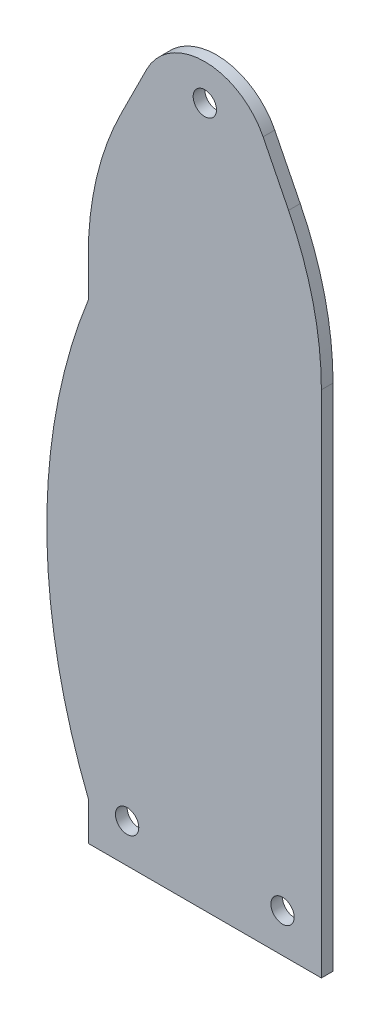
ISO-10303-21;
HEADER;
FILE_DESCRIPTION(('STEP AP214'),'2;1');
FILE_NAME('part.step','',(''),(''),'','','');
FILE_SCHEMA(('AUTOMOTIVE_DESIGN { 1 0 10303 214 1 1 1 1 }'));
ENDSEC;
DATA;
#1=APPLICATION_CONTEXT('core data for automotive mechanical design processes');
#2=APPLICATION_PROTOCOL_DEFINITION('international standard','automotive_design',2000,#1);
#3=PRODUCT_CONTEXT('',#1,'mechanical');
#4=PRODUCT('Part','Part','',(#3));
#5=PRODUCT_RELATED_PRODUCT_CATEGORY('part','',(#4));
#6=PRODUCT_DEFINITION_FORMATION('','',#4);
#7=PRODUCT_DEFINITION_CONTEXT('part definition',#1,'design');
#8=PRODUCT_DEFINITION('design','',#6,#7);
#9=PRODUCT_DEFINITION_SHAPE('','',#8);
#10=(LENGTH_UNIT() NAMED_UNIT(*) SI_UNIT(.MILLI.,.METRE.));
#11=(NAMED_UNIT(*) PLANE_ANGLE_UNIT() SI_UNIT($,.RADIAN.));
#12=(NAMED_UNIT(*) SI_UNIT($,.STERADIAN.) SOLID_ANGLE_UNIT());
#13=UNCERTAINTY_MEASURE_WITH_UNIT(LENGTH_MEASURE(1.E-05),#10,'distance_accuracy_value','');
#14=(GEOMETRIC_REPRESENTATION_CONTEXT(3) GLOBAL_UNCERTAINTY_ASSIGNED_CONTEXT((#13)) GLOBAL_UNIT_ASSIGNED_CONTEXT((#10,
#11,#12)) REPRESENTATION_CONTEXT('',''));
#15=CARTESIAN_POINT('',(0.,0.,0.));
#16=DIRECTION('',(0.,0.,1.));
#17=DIRECTION('',(1.,0.,0.));
#18=AXIS2_PLACEMENT_3D('',#15,#16,#17);
#19=CARTESIAN_POINT('',(-20.,131.114561800017,3.));
#20=DIRECTION('',(0.,0.,1.));
#21=DIRECTION('',(1.,0.,0.));
#22=AXIS2_PLACEMENT_3D('',#19,#20,#21);
#23=PLANE('',#22);
#24=CARTESIAN_POINT('',(30.,180.,3.));
#25=DIRECTION('',(0.,0.,1.));
#26=DIRECTION('',(1.,0.,0.));
#27=AXIS2_PLACEMENT_3D('',#24,#25,#26);
#28=CIRCLE('',#27,3.);
#29=CARTESIAN_POINT('',(33.,180.,3.));
#30=VERTEX_POINT('',#29);
#31=EDGE_CURVE('E217',#30,#30,#28,.T.);
#32=ORIENTED_EDGE('',*,*,#31,.F.);
#33=EDGE_LOOP('',(#32));
#34=FACE_BOUND('',#33,.T.);
#35=CARTESIAN_POINT('',(-20.,131.114561800017,3.));
#36=DIRECTION('',(0.,0.,1.));
#37=DIRECTION('',(1.,0.,0.));
#38=AXIS2_PLACEMENT_3D('',#35,#36,#37);
#39=CIRCLE('',#38,80.);
#40=CARTESIAN_POINT('',(60.,131.114561800017,3.));
#41=VERTEX_POINT('',#40);
#42=CARTESIAN_POINT('',(51.5541752799932,166.891649440013,3.));
#43=VERTEX_POINT('',#42);
#44=EDGE_CURVE('E166',#41,#43,#39,.T.);
#45=ORIENTED_EDGE('',*,*,#44,.T.);
#46=DIRECTION('',(-0.447213595499958,0.894427190999916,0.));
#47=VECTOR('',#46,1.);
#48=CARTESIAN_POINT('',(51.5541752799932,166.891649440013,3.));
#49=LINE('',#48,#47);
#50=CARTESIAN_POINT('',(45.,180.,3.));
#51=VERTEX_POINT('',#50);
#52=EDGE_CURVE('E104',#43,#51,#49,.T.);
#53=ORIENTED_EDGE('',*,*,#52,.T.);
#54=CARTESIAN_POINT('',(30.,172.5,3.));
#55=DIRECTION('',(0.,0.,1.));
#56=DIRECTION('',(-1.,0.,0.));
#57=AXIS2_PLACEMENT_3D('',#54,#55,#56);
#58=CIRCLE('',#57,16.7705098312484);
#59=CARTESIAN_POINT('',(15.,180.,3.));
#60=VERTEX_POINT('',#59);
#61=EDGE_CURVE('E187',#51,#60,#58,.T.);
#62=ORIENTED_EDGE('',*,*,#61,.T.);
#63=DIRECTION('',(-0.447213595499958,-0.894427190999916,0.));
#64=VECTOR('',#63,1.);
#65=CARTESIAN_POINT('',(8.44582472000671,166.891649440013,3.));
#66=LINE('',#65,#64);
#67=CARTESIAN_POINT('',(8.44582472000671,166.891649440013,3.));
#68=VERTEX_POINT('',#67);
#69=EDGE_CURVE('E206',#60,#68,#66,.T.);
#70=ORIENTED_EDGE('',*,*,#69,.T.);
#71=CARTESIAN_POINT('',(80.,131.114561800017,3.));
#72=DIRECTION('',(0.,0.,1.));
#73=DIRECTION('',(-1.,0.,0.));
#74=AXIS2_PLACEMENT_3D('',#71,#72,#73);
#75=CIRCLE('',#74,80.);
#76=CARTESIAN_POINT('',(0.,131.114561800017,3.));
#77=VERTEX_POINT('',#76);
#78=EDGE_CURVE('E203',#68,#77,#75,.T.);
#79=ORIENTED_EDGE('',*,*,#78,.T.);
#80=DIRECTION('',(0.,-1.,0.));
#81=VECTOR('',#80,1.);
#82=CARTESIAN_POINT('',(0.,131.114561800017,3.));
#83=LINE('',#82,#81);
#84=CARTESIAN_POINT('',(0.,121.114561800017,3.));
#85=VERTEX_POINT('',#84);
#86=EDGE_CURVE('E205',#77,#85,#83,.T.);
#87=ORIENTED_EDGE('',*,*,#86,.T.);
#88=CARTESIAN_POINT('',(139.331936536451,65.5572809000084,3.));
#89=DIRECTION('',(0.,0.,1.));
#90=DIRECTION('',(-1.,0.,0.));
#91=AXIS2_PLACEMENT_3D('',#88,#89,#90);
#92=CIRCLE('',#91,150.);
#93=CARTESIAN_POINT('',(0.,10.,3.));
#94=VERTEX_POINT('',#93);
#95=EDGE_CURVE('E129',#85,#94,#92,.T.);
#96=ORIENTED_EDGE('',*,*,#95,.T.);
#97=DIRECTION('',(0.,-1.,0.));
#98=VECTOR('',#97,1.);
#99=CARTESIAN_POINT('',(0.,10.,3.));
#100=LINE('',#99,#98);
#101=CARTESIAN_POINT('',(0.,0.,3.));
#102=VERTEX_POINT('',#101);
#103=EDGE_CURVE('E123',#94,#102,#100,.T.);
#104=ORIENTED_EDGE('',*,*,#103,.T.);
#105=DIRECTION('',(1.,0.,0.));
#106=VECTOR('',#105,1.);
#107=CARTESIAN_POINT('',(0.,0.,3.));
#108=LINE('',#107,#106);
#109=CARTESIAN_POINT('',(60.,0.,3.));
#110=VERTEX_POINT('',#109);
#111=EDGE_CURVE('E127',#102,#110,#108,.T.);
#112=ORIENTED_EDGE('',*,*,#111,.T.);
#113=DIRECTION('',(0.,1.,0.));
#114=VECTOR('',#113,1.);
#115=CARTESIAN_POINT('',(60.,131.114561800017,3.));
#116=LINE('',#115,#114);
#117=EDGE_CURVE('E55',#110,#41,#116,.T.);
#118=ORIENTED_EDGE('',*,*,#117,.T.);
#119=EDGE_LOOP('',(#45,#53,#62,#70,#79,#87,#96,#104,#112,#118));
#120=FACE_BOUND('',#119,.T.);
#121=CARTESIAN_POINT('',(50.,10.,3.));
#122=DIRECTION('',(0.,0.,1.));
#123=DIRECTION('',(-1.,0.,0.));
#124=AXIS2_PLACEMENT_3D('',#121,#122,#123);
#125=CIRCLE('',#124,3.);
#126=CARTESIAN_POINT('',(47.,10.,3.));
#127=VERTEX_POINT('',#126);
#128=EDGE_CURVE('E151',#127,#127,#125,.T.);
#129=ORIENTED_EDGE('',*,*,#128,.F.);
#130=EDGE_LOOP('',(#129));
#131=FACE_BOUND('',#130,.T.);
#132=CARTESIAN_POINT('',(10.,10.,3.));
#133=DIRECTION('',(0.,0.,1.));
#134=DIRECTION('',(1.,0.,0.));
#135=AXIS2_PLACEMENT_3D('',#132,#133,#134);
#136=CIRCLE('',#135,3.);
#137=CARTESIAN_POINT('',(13.,10.,3.));
#138=VERTEX_POINT('',#137);
#139=EDGE_CURVE('E223',#138,#138,#136,.T.);
#140=ORIENTED_EDGE('',*,*,#139,.F.);
#141=EDGE_LOOP('',(#140));
#142=FACE_BOUND('',#141,.T.);
#143=ADVANCED_FACE('F38',(#34,#120,#131,#142),#23,.T.);
#144=CARTESIAN_POINT('',(-20.,131.114561800017,0.));
#145=DIRECTION('',(0.,0.,1.));
#146=DIRECTION('',(1.,0.,0.));
#147=AXIS2_PLACEMENT_3D('',#144,#145,#146);
#148=PLANE('',#147);
#149=CARTESIAN_POINT('',(30.,180.,0.));
#150=DIRECTION('',(0.,0.,1.));
#151=DIRECTION('',(1.,0.,0.));
#152=AXIS2_PLACEMENT_3D('',#149,#150,#151);
#153=CIRCLE('',#152,3.);
#154=CARTESIAN_POINT('',(33.,180.,0.));
#155=VERTEX_POINT('',#154);
#156=EDGE_CURVE('E220',#155,#155,#153,.T.);
#157=ORIENTED_EDGE('',*,*,#156,.T.);
#158=EDGE_LOOP('',(#157));
#159=FACE_BOUND('',#158,.T.);
#160=CARTESIAN_POINT('',(-20.,131.114561800017,0.));
#161=DIRECTION('',(0.,0.,1.));
#162=DIRECTION('',(1.,0.,0.));
#163=AXIS2_PLACEMENT_3D('',#160,#161,#162);
#164=CIRCLE('',#163,80.);
#165=CARTESIAN_POINT('',(60.,131.114561800017,0.));
#166=VERTEX_POINT('',#165);
#167=CARTESIAN_POINT('',(51.5541752799932,166.891649440013,0.));
#168=VERTEX_POINT('',#167);
#169=EDGE_CURVE('E147',#166,#168,#164,.T.);
#170=ORIENTED_EDGE('',*,*,#169,.F.);
#171=DIRECTION('',(0.,1.,0.));
#172=VECTOR('',#171,1.);
#173=CARTESIAN_POINT('',(60.,131.114561800017,0.));
#174=LINE('',#173,#172);
#175=CARTESIAN_POINT('',(60.,0.,0.));
#176=VERTEX_POINT('',#175);
#177=EDGE_CURVE('E96',#176,#166,#174,.T.);
#178=ORIENTED_EDGE('',*,*,#177,.F.);
#179=DIRECTION('',(1.,0.,0.));
#180=VECTOR('',#179,1.);
#181=CARTESIAN_POINT('',(0.,0.,0.));
#182=LINE('',#181,#180);
#183=CARTESIAN_POINT('',(0.,0.,0.));
#184=VERTEX_POINT('',#183);
#185=EDGE_CURVE('E90',#184,#176,#182,.T.);
#186=ORIENTED_EDGE('',*,*,#185,.F.);
#187=DIRECTION('',(0.,-1.,0.));
#188=VECTOR('',#187,1.);
#189=CARTESIAN_POINT('',(0.,10.,0.));
#190=LINE('',#189,#188);
#191=CARTESIAN_POINT('',(0.,10.,0.));
#192=VERTEX_POINT('',#191);
#193=EDGE_CURVE('E137',#192,#184,#190,.T.);
#194=ORIENTED_EDGE('',*,*,#193,.F.);
#195=CARTESIAN_POINT('',(139.331936536451,65.5572809000084,0.));
#196=DIRECTION('',(0.,0.,1.));
#197=DIRECTION('',(-1.,0.,0.));
#198=AXIS2_PLACEMENT_3D('',#195,#196,#197);
#199=CIRCLE('',#198,150.);
#200=CARTESIAN_POINT('',(0.,121.114561800017,0.));
#201=VERTEX_POINT('',#200);
#202=EDGE_CURVE('E161',#201,#192,#199,.T.);
#203=ORIENTED_EDGE('',*,*,#202,.F.);
#204=DIRECTION('',(0.,-1.,0.));
#205=VECTOR('',#204,1.);
#206=CARTESIAN_POINT('',(0.,131.114561800017,0.));
#207=LINE('',#206,#205);
#208=CARTESIAN_POINT('',(0.,131.114561800017,0.));
#209=VERTEX_POINT('',#208);
#210=EDGE_CURVE('E159',#209,#201,#207,.T.);
#211=ORIENTED_EDGE('',*,*,#210,.F.);
#212=CARTESIAN_POINT('',(80.,131.114561800017,0.));
#213=DIRECTION('',(0.,0.,1.));
#214=DIRECTION('',(-1.,0.,0.));
#215=AXIS2_PLACEMENT_3D('',#212,#213,#214);
#216=CIRCLE('',#215,80.);
#217=CARTESIAN_POINT('',(8.44582472000671,166.891649440013,0.));
#218=VERTEX_POINT('',#217);
#219=EDGE_CURVE('E157',#218,#209,#216,.T.);
#220=ORIENTED_EDGE('',*,*,#219,.F.);
#221=DIRECTION('',(-0.447213595499958,-0.894427190999916,0.));
#222=VECTOR('',#221,1.);
#223=CARTESIAN_POINT('',(8.44582472000671,166.891649440013,0.));
#224=LINE('',#223,#222);
#225=CARTESIAN_POINT('',(15.,180.,0.));
#226=VERTEX_POINT('',#225);
#227=EDGE_CURVE('E155',#226,#218,#224,.T.);
#228=ORIENTED_EDGE('',*,*,#227,.F.);
#229=CARTESIAN_POINT('',(30.,172.5,0.));
#230=DIRECTION('',(0.,0.,1.));
#231=DIRECTION('',(-1.,0.,0.));
#232=AXIS2_PLACEMENT_3D('',#229,#230,#231);
#233=CIRCLE('',#232,16.7705098312484);
#234=CARTESIAN_POINT('',(45.,180.,0.));
#235=VERTEX_POINT('',#234);
#236=EDGE_CURVE('E153',#235,#226,#233,.T.);
#237=ORIENTED_EDGE('',*,*,#236,.F.);
#238=DIRECTION('',(-0.447213595499958,0.894427190999916,0.));
#239=VECTOR('',#238,1.);
#240=CARTESIAN_POINT('',(51.5541752799932,166.891649440013,0.));
#241=LINE('',#240,#239);
#242=EDGE_CURVE('E150',#168,#235,#241,.T.);
#243=ORIENTED_EDGE('',*,*,#242,.F.);
#244=EDGE_LOOP('',(#170,#178,#186,#194,#203,#211,#220,#228,#237,#243));
#245=FACE_BOUND('',#244,.T.);
#246=CARTESIAN_POINT('',(50.,10.,0.));
#247=DIRECTION('',(0.,0.,1.));
#248=DIRECTION('',(-1.,0.,0.));
#249=AXIS2_PLACEMENT_3D('',#246,#247,#248);
#250=CIRCLE('',#249,3.);
#251=CARTESIAN_POINT('',(47.,10.,0.));
#252=VERTEX_POINT('',#251);
#253=EDGE_CURVE('E214',#252,#252,#250,.T.);
#254=ORIENTED_EDGE('',*,*,#253,.T.);
#255=EDGE_LOOP('',(#254));
#256=FACE_BOUND('',#255,.T.);
#257=CARTESIAN_POINT('',(10.,10.,0.));
#258=DIRECTION('',(0.,0.,1.));
#259=DIRECTION('',(1.,0.,0.));
#260=AXIS2_PLACEMENT_3D('',#257,#258,#259);
#261=CIRCLE('',#260,3.);
#262=CARTESIAN_POINT('',(13.,10.,0.));
#263=VERTEX_POINT('',#262);
#264=EDGE_CURVE('E226',#263,#263,#261,.T.);
#265=ORIENTED_EDGE('',*,*,#264,.T.);
#266=EDGE_LOOP('',(#265));
#267=FACE_BOUND('',#266,.T.);
#268=ADVANCED_FACE('F191',(#159,#245,#256,#267),#148,.F.);
#269=CARTESIAN_POINT('',(-20.,131.114561800017,3.));
#270=DIRECTION('',(0.,0.,-1.));
#271=DIRECTION('',(-1.,0.,0.));
#272=AXIS2_PLACEMENT_3D('',#269,#270,#271);
#273=CYLINDRICAL_SURFACE('',#272,80.);
#274=ORIENTED_EDGE('',*,*,#169,.T.);
#275=DIRECTION('',(0.,0.,-1.));
#276=VECTOR('',#275,1.);
#277=CARTESIAN_POINT('',(51.5541752799932,166.891649440013,3.));
#278=LINE('',#277,#276);
#279=EDGE_CURVE('E11',#43,#168,#278,.T.);
#280=ORIENTED_EDGE('',*,*,#279,.F.);
#281=ORIENTED_EDGE('',*,*,#44,.F.);
#282=DIRECTION('',(0.,0.,-1.));
#283=VECTOR('',#282,1.);
#284=CARTESIAN_POINT('',(60.,131.114561800017,3.));
#285=LINE('',#284,#283);
#286=EDGE_CURVE('E143',#41,#166,#285,.T.);
#287=ORIENTED_EDGE('',*,*,#286,.T.);
#288=EDGE_LOOP('',(#274,#280,#281,#287));
#289=FACE_BOUND('',#288,.T.);
#290=ADVANCED_FACE('F40',(#289),#273,.T.);
#291=CARTESIAN_POINT('',(51.5541752799932,166.891649440013,3.));
#292=DIRECTION('',(-0.894427190999916,-0.447213595499958,0.));
#293=DIRECTION('',(0.447213595499958,-0.894427190999916,0.));
#294=AXIS2_PLACEMENT_3D('',#291,#292,#293);
#295=PLANE('',#294);
#296=ORIENTED_EDGE('',*,*,#242,.T.);
#297=DIRECTION('',(0.,0.,-1.));
#298=VECTOR('',#297,1.);
#299=CARTESIAN_POINT('',(45.,180.,3.));
#300=LINE('',#299,#298);
#301=EDGE_CURVE('E47',#51,#235,#300,.T.);
#302=ORIENTED_EDGE('',*,*,#301,.F.);
#303=ORIENTED_EDGE('',*,*,#52,.F.);
#304=ORIENTED_EDGE('',*,*,#279,.T.);
#305=EDGE_LOOP('',(#296,#302,#303,#304));
#306=FACE_BOUND('',#305,.T.);
#307=ADVANCED_FACE('F268',(#306),#295,.F.);
#308=CARTESIAN_POINT('',(30.,172.5,3.));
#309=DIRECTION('',(0.,0.,-1.));
#310=DIRECTION('',(-1.,0.,0.));
#311=AXIS2_PLACEMENT_3D('',#308,#309,#310);
#312=CYLINDRICAL_SURFACE('',#311,16.7705098312484);
#313=ORIENTED_EDGE('',*,*,#236,.T.);
#314=DIRECTION('',(0.,0.,-1.));
#315=VECTOR('',#314,1.);
#316=CARTESIAN_POINT('',(15.,180.,3.));
#317=LINE('',#316,#315);
#318=EDGE_CURVE('E179',#60,#226,#317,.T.);
#319=ORIENTED_EDGE('',*,*,#318,.F.);
#320=ORIENTED_EDGE('',*,*,#61,.F.);
#321=ORIENTED_EDGE('',*,*,#301,.T.);
#322=EDGE_LOOP('',(#313,#319,#320,#321));
#323=FACE_BOUND('',#322,.T.);
#324=ADVANCED_FACE('F185',(#323),#312,.T.);
#325=CARTESIAN_POINT('',(8.44582472000671,166.891649440013,3.));
#326=DIRECTION('',(0.894427190999916,-0.447213595499958,0.));
#327=DIRECTION('',(0.447213595499958,0.894427190999916,0.));
#328=AXIS2_PLACEMENT_3D('',#325,#326,#327);
#329=PLANE('',#328);
#330=ORIENTED_EDGE('',*,*,#227,.T.);
#331=DIRECTION('',(0.,0.,-1.));
#332=VECTOR('',#331,1.);
#333=CARTESIAN_POINT('',(8.44582472000671,166.891649440013,3.));
#334=LINE('',#333,#332);
#335=EDGE_CURVE('E176',#68,#218,#334,.T.);
#336=ORIENTED_EDGE('',*,*,#335,.F.);
#337=ORIENTED_EDGE('',*,*,#69,.F.);
#338=ORIENTED_EDGE('',*,*,#318,.T.);
#339=EDGE_LOOP('',(#330,#336,#337,#338));
#340=FACE_BOUND('',#339,.T.);
#341=ADVANCED_FACE('F197',(#340),#329,.F.);
#342=CARTESIAN_POINT('',(80.,131.114561800017,3.));
#343=DIRECTION('',(0.,0.,-1.));
#344=DIRECTION('',(-1.,0.,0.));
#345=AXIS2_PLACEMENT_3D('',#342,#343,#344);
#346=CYLINDRICAL_SURFACE('',#345,80.);
#347=ORIENTED_EDGE('',*,*,#219,.T.);
#348=DIRECTION('',(0.,0.,-1.));
#349=VECTOR('',#348,1.);
#350=CARTESIAN_POINT('',(0.,131.114561800017,3.));
#351=LINE('',#350,#349);
#352=EDGE_CURVE('E173',#77,#209,#351,.T.);
#353=ORIENTED_EDGE('',*,*,#352,.F.);
#354=ORIENTED_EDGE('',*,*,#78,.F.);
#355=ORIENTED_EDGE('',*,*,#335,.T.);
#356=EDGE_LOOP('',(#347,#353,#354,#355));
#357=FACE_BOUND('',#356,.T.);
#358=ADVANCED_FACE('F201',(#357),#346,.T.);
#359=CARTESIAN_POINT('',(0.,131.114561800017,3.));
#360=DIRECTION('',(1.,0.,0.));
#361=DIRECTION('',(0.,1.,0.));
#362=AXIS2_PLACEMENT_3D('',#359,#360,#361);
#363=PLANE('',#362);
#364=ORIENTED_EDGE('',*,*,#210,.T.);
#365=DIRECTION('',(0.,0.,-1.));
#366=VECTOR('',#365,1.);
#367=CARTESIAN_POINT('',(0.,121.114561800017,3.));
#368=LINE('',#367,#366);
#369=EDGE_CURVE('E170',#85,#201,#368,.T.);
#370=ORIENTED_EDGE('',*,*,#369,.F.);
#371=ORIENTED_EDGE('',*,*,#86,.F.);
#372=ORIENTED_EDGE('',*,*,#352,.T.);
#373=EDGE_LOOP('',(#364,#370,#371,#372));
#374=FACE_BOUND('',#373,.T.);
#375=ADVANCED_FACE('F258',(#374),#363,.F.);
#376=CARTESIAN_POINT('',(139.331936536451,65.5572809000084,3.));
#377=DIRECTION('',(0.,0.,-1.));
#378=DIRECTION('',(-1.,0.,0.));
#379=AXIS2_PLACEMENT_3D('',#376,#377,#378);
#380=CYLINDRICAL_SURFACE('',#379,150.);
#381=ORIENTED_EDGE('',*,*,#202,.T.);
#382=DIRECTION('',(0.,0.,-1.));
#383=VECTOR('',#382,1.);
#384=CARTESIAN_POINT('',(0.,10.,3.));
#385=LINE('',#384,#383);
#386=EDGE_CURVE('E138',#94,#192,#385,.T.);
#387=ORIENTED_EDGE('',*,*,#386,.F.);
#388=ORIENTED_EDGE('',*,*,#95,.F.);
#389=ORIENTED_EDGE('',*,*,#369,.T.);
#390=EDGE_LOOP('',(#381,#387,#388,#389));
#391=FACE_BOUND('',#390,.T.);
#392=ADVANCED_FACE('F255',(#391),#380,.T.);
#393=CARTESIAN_POINT('',(0.,10.,3.));
#394=DIRECTION('',(1.,0.,0.));
#395=DIRECTION('',(0.,1.,0.));
#396=AXIS2_PLACEMENT_3D('',#393,#394,#395);
#397=PLANE('',#396);
#398=ORIENTED_EDGE('',*,*,#193,.T.);
#399=DIRECTION('',(0.,0.,-1.));
#400=VECTOR('',#399,1.);
#401=CARTESIAN_POINT('',(0.,0.,3.));
#402=LINE('',#401,#400);
#403=EDGE_CURVE('E134',#102,#184,#402,.T.);
#404=ORIENTED_EDGE('',*,*,#403,.F.);
#405=ORIENTED_EDGE('',*,*,#103,.F.);
#406=ORIENTED_EDGE('',*,*,#386,.T.);
#407=EDGE_LOOP('',(#398,#404,#405,#406));
#408=FACE_BOUND('',#407,.T.);
#409=ADVANCED_FACE('F135',(#408),#397,.F.);
#410=CARTESIAN_POINT('',(0.,0.,3.));
#411=DIRECTION('',(0.,1.,0.));
#412=DIRECTION('',(0.,0.,1.));
#413=AXIS2_PLACEMENT_3D('',#410,#411,#412);
#414=PLANE('',#413);
#415=ORIENTED_EDGE('',*,*,#185,.T.);
#416=DIRECTION('',(0.,0.,-1.));
#417=VECTOR('',#416,1.);
#418=CARTESIAN_POINT('',(60.,0.,3.));
#419=LINE('',#418,#417);
#420=EDGE_CURVE('E139',#110,#176,#419,.T.);
#421=ORIENTED_EDGE('',*,*,#420,.F.);
#422=ORIENTED_EDGE('',*,*,#111,.F.);
#423=ORIENTED_EDGE('',*,*,#403,.T.);
#424=EDGE_LOOP('',(#415,#421,#422,#423));
#425=FACE_BOUND('',#424,.T.);
#426=ADVANCED_FACE('F141',(#425),#414,.F.);
#427=CARTESIAN_POINT('',(60.,131.114561800017,3.));
#428=DIRECTION('',(-1.,0.,0.));
#429=DIRECTION('',(0.,-1.,0.));
#430=AXIS2_PLACEMENT_3D('',#427,#428,#429);
#431=PLANE('',#430);
#432=ORIENTED_EDGE('',*,*,#177,.T.);
#433=ORIENTED_EDGE('',*,*,#286,.F.);
#434=ORIENTED_EDGE('',*,*,#117,.F.);
#435=ORIENTED_EDGE('',*,*,#420,.T.);
#436=EDGE_LOOP('',(#432,#433,#434,#435));
#437=FACE_BOUND('',#436,.T.);
#438=ADVANCED_FACE('F248',(#437),#431,.F.);
#439=CARTESIAN_POINT('',(50.,10.,3.));
#440=DIRECTION('',(0.,0.,-1.));
#441=DIRECTION('',(-1.,0.,0.));
#442=AXIS2_PLACEMENT_3D('',#439,#440,#441);
#443=CYLINDRICAL_SURFACE('',#442,3.);
#444=ORIENTED_EDGE('',*,*,#128,.T.);
#445=EDGE_LOOP('',(#444));
#446=FACE_BOUND('',#445,.T.);
#447=ORIENTED_EDGE('',*,*,#253,.F.);
#448=EDGE_LOOP('',(#447));
#449=FACE_BOUND('',#448,.T.);
#450=ADVANCED_FACE('F245',(#446,#449),#443,.F.);
#451=CARTESIAN_POINT('',(30.,180.,3.));
#452=DIRECTION('',(0.,0.,-1.));
#453=DIRECTION('',(-1.,0.,0.));
#454=AXIS2_PLACEMENT_3D('',#451,#452,#453);
#455=CYLINDRICAL_SURFACE('',#454,3.);
#456=ORIENTED_EDGE('',*,*,#31,.T.);
#457=EDGE_LOOP('',(#456));
#458=FACE_BOUND('',#457,.T.);
#459=ORIENTED_EDGE('',*,*,#156,.F.);
#460=EDGE_LOOP('',(#459));
#461=FACE_BOUND('',#460,.T.);
#462=ADVANCED_FACE('F344',(#458,#461),#455,.F.);
#463=CARTESIAN_POINT('',(10.,10.,3.));
#464=DIRECTION('',(0.,0.,-1.));
#465=DIRECTION('',(-1.,0.,0.));
#466=AXIS2_PLACEMENT_3D('',#463,#464,#465);
#467=CYLINDRICAL_SURFACE('',#466,3.);
#468=ORIENTED_EDGE('',*,*,#139,.T.);
#469=EDGE_LOOP('',(#468));
#470=FACE_BOUND('',#469,.T.);
#471=ORIENTED_EDGE('',*,*,#264,.F.);
#472=EDGE_LOOP('',(#471));
#473=FACE_BOUND('',#472,.T.);
#474=ADVANCED_FACE('F232',(#470,#473),#467,.F.);
#475=CLOSED_SHELL('',(#143,#268,#290,#307,#324,#341,#358,#375,#392,#409,#426,#438,#450,#462,#474));
#476=MANIFOLD_SOLID_BREP('B2',#475);
#477=ADVANCED_BREP_SHAPE_REPRESENTATION('',(#18,#476),#14);
#478=SHAPE_DEFINITION_REPRESENTATION(#9,#477);
ENDSEC;
END-ISO-10303-21;
